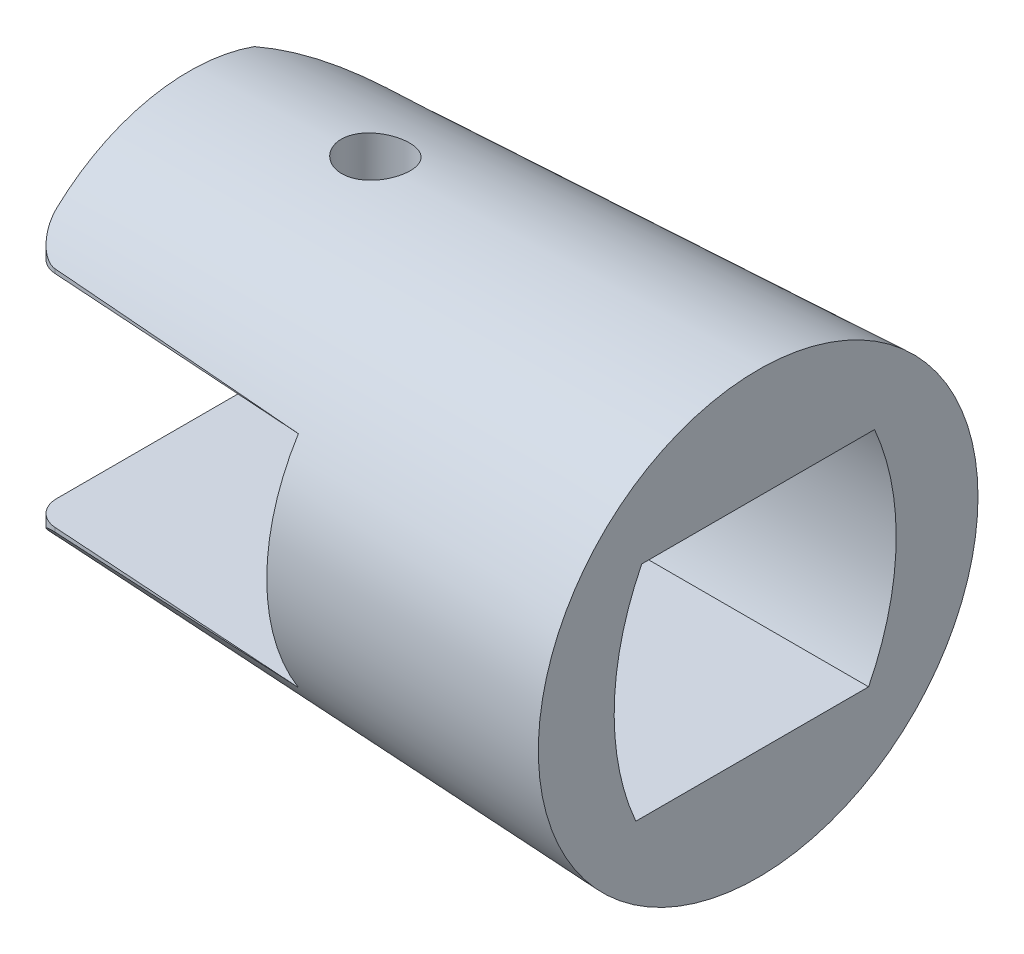
ISO-10303-21;
HEADER;
FILE_DESCRIPTION(('STEP AP214'),'2;1');
FILE_NAME('part.step','',(''),(''),'','','');
FILE_SCHEMA(('AUTOMOTIVE_DESIGN { 1 0 10303 214 1 1 1 1 }'));
ENDSEC;
DATA;
#1=APPLICATION_CONTEXT('core data for automotive mechanical design processes');
#2=APPLICATION_PROTOCOL_DEFINITION('international standard','automotive_design',2000,#1);
#3=PRODUCT_CONTEXT('',#1,'mechanical');
#4=PRODUCT('Part','Part','',(#3));
#5=PRODUCT_RELATED_PRODUCT_CATEGORY('part','',(#4));
#6=PRODUCT_DEFINITION_FORMATION('','',#4);
#7=PRODUCT_DEFINITION_CONTEXT('part definition',#1,'design');
#8=PRODUCT_DEFINITION('design','',#6,#7);
#9=PRODUCT_DEFINITION_SHAPE('','',#8);
#10=(LENGTH_UNIT() NAMED_UNIT(*) SI_UNIT(.MILLI.,.METRE.));
#11=(NAMED_UNIT(*) PLANE_ANGLE_UNIT() SI_UNIT($,.RADIAN.));
#12=(NAMED_UNIT(*) SI_UNIT($,.STERADIAN.) SOLID_ANGLE_UNIT());
#13=UNCERTAINTY_MEASURE_WITH_UNIT(LENGTH_MEASURE(1.E-05),#10,'distance_accuracy_value','');
#14=(GEOMETRIC_REPRESENTATION_CONTEXT(3) GLOBAL_UNCERTAINTY_ASSIGNED_CONTEXT((#13)) GLOBAL_UNIT_ASSIGNED_CONTEXT((#10,
#11,#12)) REPRESENTATION_CONTEXT('',''));
#15=CARTESIAN_POINT('',(0.,0.,0.));
#16=DIRECTION('',(0.,0.,1.));
#17=DIRECTION('',(1.,0.,0.));
#18=AXIS2_PLACEMENT_3D('',#15,#16,#17);
#19=CARTESIAN_POINT('',(-11.605,4.48375,-10.55));
#20=DIRECTION('',(1.,0.,0.));
#21=DIRECTION('',(0.,1.,0.));
#22=AXIS2_PLACEMENT_3D('',#19,#20,#21);
#23=PLANE('',#22);
#24=DIRECTION('',(0.,0.,1.));
#25=VECTOR('',#24,1.);
#26=CARTESIAN_POINT('',(-11.605,4.48375,-10.55));
#27=LINE('',#26,#25);
#28=CARTESIAN_POINT('',(-11.605,4.48375,4.7475));
#29=VERTEX_POINT('',#28);
#30=CARTESIAN_POINT('',(-11.605,4.48375,7.15049550293545));
#31=VERTEX_POINT('',#30);
#32=EDGE_CURVE('E220',#29,#31,#27,.T.);
#33=ORIENTED_EDGE('',*,*,#32,.F.);
#34=CARTESIAN_POINT('',(-11.605,-0.258290682961154,-4.67670023986871));
#35=DIRECTION('',(1.,0.,0.));
#36=DIRECTION('',(0.,1.,0.));
#37=AXIS2_PLACEMENT_3D('',#34,#35,#36);
#38=CIRCLE('',#37,10.55);
#39=CARTESIAN_POINT('',(-11.605,-4.48375,4.99015));
#40=VERTEX_POINT('',#39);
#41=EDGE_CURVE('E238',#29,#40,#38,.T.);
#42=ORIENTED_EDGE('',*,*,#41,.T.);
#43=DIRECTION('',(0.,0.,1.));
#44=VECTOR('',#43,1.);
#45=CARTESIAN_POINT('',(-11.605,-4.48375,-10.55));
#46=LINE('',#45,#44);
#47=CARTESIAN_POINT('',(-11.605,-4.48375,7.15049550293544));
#48=VERTEX_POINT('',#47);
#49=EDGE_CURVE('E215',#40,#48,#46,.T.);
#50=ORIENTED_EDGE('',*,*,#49,.T.);
#51=CARTESIAN_POINT('',(-11.605,0.,0.));
#52=DIRECTION('',(1.,0.,0.));
#53=DIRECTION('',(0.,1.,0.));
#54=AXIS2_PLACEMENT_3D('',#51,#52,#53);
#55=CIRCLE('',#54,8.44);
#56=EDGE_CURVE('E366',#48,#31,#55,.F.);
#57=ORIENTED_EDGE('',*,*,#56,.T.);
#58=EDGE_LOOP('',(#33,#42,#50,#57));
#59=FACE_BOUND('',#58,.T.);
#60=ADVANCED_FACE('F40',(#59),#23,.F.);
#61=CARTESIAN_POINT('',(-26.3539,4.48375,-10.55));
#62=DIRECTION('',(0.,1.,0.));
#63=DIRECTION('',(0.,0.,1.));
#64=AXIS2_PLACEMENT_3D('',#61,#62,#63);
#65=PLANE('',#64);
#66=DIRECTION('',(-0.997866486605557,0.,-0.0652876321325967));
#67=VECTOR('',#66,1.);
#68=CARTESIAN_POINT('',(-27.4441910846819,4.48375,6.11418123174238));
#69=LINE('',#68,#67);
#70=CARTESIAN_POINT('',(-22.2238784518999,4.48375,6.45573178520931));
#71=VERTEX_POINT('',#70);
#72=EDGE_CURVE('E207',#31,#71,#69,.T.);
#73=ORIENTED_EDGE('',*,*,#72,.T.);
#74=CARTESIAN_POINT('',(-22.155,4.48375,5.40298264184044));
#75=DIRECTION('',(0.,1.,0.));
#76=DIRECTION('',(0.,0.,1.));
#77=AXIS2_PLACEMENT_3D('',#74,#75,#76);
#78=CIRCLE('',#77,1.055);
#79=CARTESIAN_POINT('',(-23.21,4.48375,5.40298264184044));
#80=VERTEX_POINT('',#79);
#81=EDGE_CURVE('E12',#71,#80,#78,.F.);
#82=ORIENTED_EDGE('',*,*,#81,.T.);
#83=DIRECTION('',(0.,0.,1.));
#84=VECTOR('',#83,1.);
#85=CARTESIAN_POINT('',(-23.21,4.48375,0.));
#86=LINE('',#85,#84);
#87=CARTESIAN_POINT('',(-23.21,4.48375,-2.65564999067094));
#88=VERTEX_POINT('',#87);
#89=EDGE_CURVE('E230',#88,#80,#86,.T.);
#90=ORIENTED_EDGE('',*,*,#89,.F.);
#91=CARTESIAN_POINT('',(-15.4663,4.48375,1.52193687257918));
#92=DIRECTION('',(0.,1.,0.));
#93=DIRECTION('',(0.,0.,1.));
#94=AXIS2_PLACEMENT_3D('',#91,#92,#93);
#95=CIRCLE('',#94,8.7987);
#96=CARTESIAN_POINT('',(-18.3666793449828,4.48375,-6.78498321522742));
#97=VERTEX_POINT('',#96);
#98=EDGE_CURVE('E193',#88,#97,#95,.F.);
#99=ORIENTED_EDGE('',*,*,#98,.T.);
#100=CARTESIAN_POINT('',(-44.5726728138678,4.48375,-5.299054973512));
#101=CARTESIAN_POINT('',(-42.3632557991479,4.48375,-5.43057600760556));
#102=CARTESIAN_POINT('',(-40.1537228781907,4.48375,-5.56013068389908));
#103=CARTESIAN_POINT('',(-35.7344699549912,4.48375,-5.81592825272662));
#104=CARTESIAN_POINT('',(-33.5247499531615,4.48375,-5.94217115238378));
#105=CARTESIAN_POINT('',(-27.8927760109839,4.48375,-6.26049054385434));
#106=CARTESIAN_POINT('',(-24.4704159019874,4.48375,-6.45068613810378));
#107=CARTESIAN_POINT('',(-17.6254235537313,4.48375,-6.82613940047241));
#108=CARTESIAN_POINT('',(-14.2027913143114,4.48375,-7.01139706565928));
#109=CARTESIAN_POINT('',(-7.35729570575324,4.48375,-7.37803776065809));
#110=CARTESIAN_POINT('',(-3.93443233516793,4.48375,-7.55942076340467));
#111=CARTESIAN_POINT('',(2.91145568007266,4.48375,-7.91902922244784));
#112=CARTESIAN_POINT('',(6.33448032450069,4.48375,-8.09725468306763));
#113=CARTESIAN_POINT('',(9.75756731386789,4.48375,-8.27426083109337));
#114=B_SPLINE_CURVE_WITH_KNOTS('',3,(#100,#101,#102,#103,#104,#105,#106,#107,#108,#109,#110,
#111,#112,#113),.UNSPECIFIED.,.F.,.F.,(4,2,2,2,2,2,4),(0.,6.639981763878,13.2799492449581,
23.5628674158611,33.8457916930049,44.1287877751667,54.4117697771162),.UNSPECIFIED.);
#115=CARTESIAN_POINT('',(-11.605,4.48375,-7.15049550293545));
#116=VERTEX_POINT('',#115);
#117=EDGE_CURVE('E294',#97,#116,#114,.T.);
#118=ORIENTED_EDGE('',*,*,#117,.T.);
#119=CARTESIAN_POINT('',(-11.605,4.48375,-4.7475));
#120=VERTEX_POINT('',#119);
#121=EDGE_CURVE('E216',#116,#120,#27,.T.);
#122=ORIENTED_EDGE('',*,*,#121,.T.);
#123=DIRECTION('',(1.,0.,0.));
#124=VECTOR('',#123,1.);
#125=CARTESIAN_POINT('',(-12.66,4.48375,-4.7475));
#126=LINE('',#125,#124);
#127=CARTESIAN_POINT('',(0.,4.48375,-4.7475));
#128=VERTEX_POINT('',#127);
#129=EDGE_CURVE('E155',#120,#128,#126,.T.);
#130=ORIENTED_EDGE('',*,*,#129,.T.);
#131=DIRECTION('',(0.,0.,1.));
#132=VECTOR('',#131,1.);
#133=CARTESIAN_POINT('',(0.,4.48375,4.7475));
#134=LINE('',#133,#132);
#135=CARTESIAN_POINT('',(0.,4.48375,4.7475));
#136=VERTEX_POINT('',#135);
#137=EDGE_CURVE('E172',#128,#136,#134,.T.);
#138=ORIENTED_EDGE('',*,*,#137,.T.);
#139=DIRECTION('',(1.,0.,0.));
#140=VECTOR('',#139,1.);
#141=CARTESIAN_POINT('',(-12.66,4.48375,4.7475));
#142=LINE('',#141,#140);
#143=EDGE_CURVE('E177',#29,#136,#142,.T.);
#144=ORIENTED_EDGE('',*,*,#143,.F.);
#145=ORIENTED_EDGE('',*,*,#32,.T.);
#146=EDGE_LOOP('',(#73,#82,#90,#99,#118,#122,#130,#138,#144,#145));
#147=FACE_BOUND('',#146,.T.);
#148=CARTESIAN_POINT('',(-16.1415,4.48375,-0.527500000000002));
#149=DIRECTION('',(0.,1.,0.));
#150=DIRECTION('',(0.,0.,1.));
#151=AXIS2_PLACEMENT_3D('',#148,#149,#150);
#152=CIRCLE('',#151,1.31875);
#153=CARTESIAN_POINT('',(-16.1415,4.48375,0.791249999999997));
#154=VERTEX_POINT('',#153);
#155=EDGE_CURVE('E185',#154,#154,#152,.T.);
#156=ORIENTED_EDGE('',*,*,#155,.T.);
#157=EDGE_LOOP('',(#156));
#158=FACE_BOUND('',#157,.T.);
#159=ADVANCED_FACE('F343',(#147,#158),#65,.F.);
#160=CARTESIAN_POINT('',(-26.3539,-4.48375,-10.55));
#161=DIRECTION('',(0.,-1.,0.));
#162=DIRECTION('',(0.,0.,-1.));
#163=AXIS2_PLACEMENT_3D('',#160,#161,#162);
#164=PLANE('',#163);
#165=DIRECTION('',(0.,0.,-1.));
#166=VECTOR('',#165,1.);
#167=CARTESIAN_POINT('',(-23.21,-4.48375,0.));
#168=LINE('',#167,#166);
#169=CARTESIAN_POINT('',(-23.21,-4.48375,5.40298264184044));
#170=VERTEX_POINT('',#169);
#171=CARTESIAN_POINT('',(-23.21,-4.48375,-2.65564999067094));
#172=VERTEX_POINT('',#171);
#173=EDGE_CURVE('E219',#170,#172,#168,.T.);
#174=ORIENTED_EDGE('',*,*,#173,.F.);
#175=CARTESIAN_POINT('',(-22.155,-4.48375,5.40298264184044));
#176=DIRECTION('',(0.,-1.,0.));
#177=DIRECTION('',(0.,0.,-1.));
#178=AXIS2_PLACEMENT_3D('',#175,#176,#177);
#179=CIRCLE('',#178,1.055);
#180=CARTESIAN_POINT('',(-22.2238784518999,-4.48375,6.45573178520931));
#181=VERTEX_POINT('',#180);
#182=EDGE_CURVE('E237',#170,#181,#179,.F.);
#183=ORIENTED_EDGE('',*,*,#182,.T.);
#184=DIRECTION('',(0.997866486605557,0.,0.0652876321325967));
#185=VECTOR('',#184,1.);
#186=CARTESIAN_POINT('',(-27.4441910846819,-4.48375,6.11418123174238));
#187=LINE('',#186,#185);
#188=EDGE_CURVE('E383',#181,#48,#187,.T.);
#189=ORIENTED_EDGE('',*,*,#188,.T.);
#190=ORIENTED_EDGE('',*,*,#49,.F.);
#191=DIRECTION('',(1.,0.,0.));
#192=VECTOR('',#191,1.);
#193=CARTESIAN_POINT('',(-12.66,-4.48375,4.99015));
#194=LINE('',#193,#192);
#195=CARTESIAN_POINT('',(0.,-4.48375,4.99015));
#196=VERTEX_POINT('',#195);
#197=EDGE_CURVE('E156',#40,#196,#194,.T.);
#198=ORIENTED_EDGE('',*,*,#197,.T.);
#199=DIRECTION('',(0.,0.,-1.));
#200=VECTOR('',#199,1.);
#201=CARTESIAN_POINT('',(0.,-4.48375,4.99015));
#202=LINE('',#201,#200);
#203=CARTESIAN_POINT('',(0.,-4.48375,-4.50485));
#204=VERTEX_POINT('',#203);
#205=EDGE_CURVE('E160',#196,#204,#202,.T.);
#206=ORIENTED_EDGE('',*,*,#205,.T.);
#207=DIRECTION('',(1.,0.,0.));
#208=VECTOR('',#207,1.);
#209=CARTESIAN_POINT('',(-12.66,-4.48375,-4.50485));
#210=LINE('',#209,#208);
#211=CARTESIAN_POINT('',(-11.605,-4.48375,-4.50485));
#212=VERTEX_POINT('',#211);
#213=EDGE_CURVE('E144',#212,#204,#210,.T.);
#214=ORIENTED_EDGE('',*,*,#213,.F.);
#215=CARTESIAN_POINT('',(-11.605,-4.48375,-7.15049550293544));
#216=VERTEX_POINT('',#215);
#217=EDGE_CURVE('E221',#216,#212,#46,.T.);
#218=ORIENTED_EDGE('',*,*,#217,.F.);
#219=CARTESIAN_POINT('',(9.75756731386789,-4.48375,-8.27426083109337));
#220=CARTESIAN_POINT('',(6.76081513792658,-4.48375,-8.11931135386581));
#221=CARTESIAN_POINT('',(3.76411162587657,-4.48375,-7.96341368107027));
#222=CARTESIAN_POINT('',(-2.22916595103775,-4.48375,-7.64926372516363));
#223=CARTESIAN_POINT('',(-5.22574001614723,-4.48375,-7.49101144672747));
#224=CARTESIAN_POINT('',(-11.2518734534107,-4.48375,-7.16992795627611));
#225=CARTESIAN_POINT('',(-14.2814311613988,-4.48375,-7.00706546151415));
#226=CARTESIAN_POINT('',(-20.3403534260021,-4.48375,-6.6777987846476));
#227=CARTESIAN_POINT('',(-23.3697179826739,-4.48375,-6.51139460358648));
#228=CARTESIAN_POINT('',(-29.4282131322181,-4.48375,-6.17415191948557));
#229=CARTESIAN_POINT('',(-32.4573437241116,-4.48375,-6.00331339880318));
#230=CARTESIAN_POINT('',(-37.0007957088804,-4.48375,-5.74277052608293));
#231=CARTESIAN_POINT('',(-38.515239970922,-4.48375,-5.65520866553543));
#232=CARTESIAN_POINT('',(-41.5440323218638,-4.48375,-5.47842983401376));
#233=CARTESIAN_POINT('',(-43.058380410734,-4.48375,-5.38921286252695));
#234=CARTESIAN_POINT('',(-44.5726728138679,-4.48375,-5.29905497351199));
#235=B_SPLINE_CURVE_WITH_KNOTS('',3,(#219,#220,#221,#222,#223,#224,#225,#226,#227,#228,#229,
#230,#231,#232,#233,#234),.UNSPECIFIED.,.F.,.F.,(4,2,2,2,2,2,2,4),(0.,9.00226657237608,
18.0045152736493,27.1063098999938,36.2081018447502,45.3099300077749,49.860849604712,
54.4117706112821),.UNSPECIFIED.);
#236=CARTESIAN_POINT('',(-18.3666793449826,-4.48375,-6.78498321522702));
#237=VERTEX_POINT('',#236);
#238=EDGE_CURVE('E286',#216,#237,#235,.T.);
#239=ORIENTED_EDGE('',*,*,#238,.T.);
#240=CARTESIAN_POINT('',(-15.4663,-4.48375,1.52193687257918));
#241=DIRECTION('',(0.,-1.,0.));
#242=DIRECTION('',(0.,0.,-1.));
#243=AXIS2_PLACEMENT_3D('',#240,#241,#242);
#244=CIRCLE('',#243,8.7987);
#245=EDGE_CURVE('E403',#237,#172,#244,.F.);
#246=ORIENTED_EDGE('',*,*,#245,.T.);
#247=EDGE_LOOP('',(#174,#183,#189,#190,#198,#206,#214,#218,#239,#246));
#248=FACE_BOUND('',#247,.T.);
#249=CARTESIAN_POINT('',(-16.1415,-4.48375,-0.527500000000002));
#250=DIRECTION('',(0.,-1.,0.));
#251=DIRECTION('',(0.,0.,-1.));
#252=AXIS2_PLACEMENT_3D('',#249,#250,#251);
#253=CIRCLE('',#252,1.31875);
#254=CARTESIAN_POINT('',(-16.1415,-4.48375,-1.84625));
#255=VERTEX_POINT('',#254);
#256=EDGE_CURVE('E182',#255,#255,#253,.T.);
#257=ORIENTED_EDGE('',*,*,#256,.T.);
#258=EDGE_LOOP('',(#257));
#259=FACE_BOUND('',#258,.T.);
#260=ADVANCED_FACE('F162',(#248,#259),#164,.F.);
#261=CARTESIAN_POINT('',(-23.21,0.,0.));
#262=DIRECTION('',(1.,0.,0.));
#263=DIRECTION('',(0.,0.,-1.));
#264=AXIS2_PLACEMENT_3D('',#261,#262,#263);
#265=PLANE('',#264);
#266=ORIENTED_EDGE('',*,*,#89,.T.);
#267=DIRECTION('',(0.,1.,0.));
#268=VECTOR('',#267,1.);
#269=CARTESIAN_POINT('',(-23.21,0.,5.40298264184044));
#270=LINE('',#269,#268);
#271=CARTESIAN_POINT('',(-23.21,5.78060746384151,5.40298300002569));
#272=VERTEX_POINT('',#271);
#273=EDGE_CURVE('E250',#80,#272,#270,.T.);
#274=ORIENTED_EDGE('',*,*,#273,.T.);
#275=CARTESIAN_POINT('',(-23.21,0.,0.));
#276=DIRECTION('',(1.,0.,0.));
#277=DIRECTION('',(0.,0.,-1.));
#278=AXIS2_PLACEMENT_3D('',#275,#276,#277);
#279=CIRCLE('',#278,7.9125);
#280=CARTESIAN_POINT('',(-23.2099999999998,7.45353469013513,-2.65564999067126));
#281=VERTEX_POINT('',#280);
#282=EDGE_CURVE('E375',#281,#272,#279,.T.);
#283=ORIENTED_EDGE('',*,*,#282,.F.);
#284=DIRECTION('',(0.,1.,0.));
#285=VECTOR('',#284,1.);
#286=CARTESIAN_POINT('',(-23.21,-10.55,-2.65564999067094));
#287=LINE('',#286,#285);
#288=EDGE_CURVE('E199',#281,#88,#287,.F.);
#289=ORIENTED_EDGE('',*,*,#288,.T.);
#290=EDGE_LOOP('',(#266,#274,#283,#289));
#291=FACE_BOUND('',#290,.T.);
#292=ADVANCED_FACE('F352',(#291),#265,.F.);
#293=CARTESIAN_POINT('',(0.,0.,0.));
#294=DIRECTION('',(1.,0.,0.));
#295=DIRECTION('',(0.,0.,-1.));
#296=AXIS2_PLACEMENT_3D('',#293,#294,#295);
#297=PLANE('',#296);
#298=CARTESIAN_POINT('',(0.,-0.258290682961154,-4.67670023986871));
#299=DIRECTION('',(1.,0.,0.));
#300=DIRECTION('',(0.,0.,-1.));
#301=AXIS2_PLACEMENT_3D('',#298,#299,#300);
#302=CIRCLE('',#301,10.55);
#303=EDGE_CURVE('E167',#136,#196,#302,.T.);
#304=ORIENTED_EDGE('',*,*,#303,.F.);
#305=ORIENTED_EDGE('',*,*,#137,.F.);
#306=CARTESIAN_POINT('',(0.,0.258290682961155,4.91935023986871));
#307=DIRECTION('',(1.,0.,0.));
#308=DIRECTION('',(0.,0.,1.));
#309=AXIS2_PLACEMENT_3D('',#306,#307,#308);
#310=CIRCLE('',#309,10.55);
#311=EDGE_CURVE('E148',#204,#128,#310,.T.);
#312=ORIENTED_EDGE('',*,*,#311,.F.);
#313=ORIENTED_EDGE('',*,*,#205,.F.);
#314=EDGE_LOOP('',(#304,#305,#312,#313));
#315=FACE_BOUND('',#314,.T.);
#316=CARTESIAN_POINT('',(0.,0.,0.));
#317=DIRECTION('',(1.,0.,0.));
#318=DIRECTION('',(0.,0.,-1.));
#319=AXIS2_PLACEMENT_3D('',#316,#317,#318);
#320=CIRCLE('',#319,8.9675);
#321=CARTESIAN_POINT('',(0.,0.,-8.9675));
#322=VERTEX_POINT('',#321);
#323=EDGE_CURVE('E413',#322,#322,#320,.T.);
#324=ORIENTED_EDGE('',*,*,#323,.T.);
#325=EDGE_LOOP('',(#324));
#326=FACE_BOUND('',#325,.T.);
#327=ADVANCED_FACE('F169',(#315,#326),#297,.T.);
#328=CARTESIAN_POINT('',(-23.21,-5.78061093435922,5.40298181924811));
#329=VERTEX_POINT('',#328);
#330=CARTESIAN_POINT('',(-23.2099999999997,-7.45353469013508,-2.65564999067144));
#331=VERTEX_POINT('',#330);
#332=EDGE_CURVE('E379',#329,#331,#279,.T.);
#333=ORIENTED_EDGE('',*,*,#332,.F.);
#334=DIRECTION('',(0.,1.,0.));
#335=VECTOR('',#334,1.);
#336=CARTESIAN_POINT('',(-23.21,0.,5.40298264184044));
#337=LINE('',#336,#335);
#338=EDGE_CURVE('E234',#329,#170,#337,.T.);
#339=ORIENTED_EDGE('',*,*,#338,.T.);
#340=ORIENTED_EDGE('',*,*,#173,.T.);
#341=DIRECTION('',(0.,1.,0.));
#342=VECTOR('',#341,1.);
#343=CARTESIAN_POINT('',(-23.21,-10.55,-2.65564999067094));
#344=LINE('',#343,#342);
#345=EDGE_CURVE('E190',#172,#331,#344,.F.);
#346=ORIENTED_EDGE('',*,*,#345,.T.);
#347=EDGE_LOOP('',(#333,#339,#340,#346));
#348=FACE_BOUND('',#347,.T.);
#349=ADVANCED_FACE('F269',(#348),#265,.F.);
#350=CARTESIAN_POINT('',(-23.21,0.,0.));
#351=DIRECTION('',(1.,0.,0.));
#352=DIRECTION('',(0.,0.,-1.));
#353=AXIS2_PLACEMENT_3D('',#350,#351,#352);
#354=CONICAL_SURFACE('',#353,7.9125,0.0454232794215769);
#355=CARTESIAN_POINT('',(-17.2548440053607,-8.08956633232779,-1.2343003170822));
#356=CARTESIAN_POINT('',(-17.2152185245078,-8.08186499791986,-1.296713214045));
#357=CARTESIAN_POINT('',(-17.170312438701,-8.07417381548192,-1.35582242798965));
#358=CARTESIAN_POINT('',(-17.0711457611492,-8.05952308985586,-1.46576969851495));
#359=CARTESIAN_POINT('',(-17.0168767224265,-8.05256421654207,-1.51660020508738));
#360=CARTESIAN_POINT('',(-16.9004469289519,-8.04010586170184,-1.60851874114574));
#361=CARTESIAN_POINT('',(-16.838283814141,-8.03460681814035,-1.64960384651162));
#362=CARTESIAN_POINT('',(-16.7078263639348,-8.02573187317943,-1.7207706218764));
#363=CARTESIAN_POINT('',(-16.6395338341232,-8.02235534886554,-1.75085551911813));
#364=CARTESIAN_POINT('',(-16.4997018024758,-8.01825669444364,-1.79879229786896));
#365=CARTESIAN_POINT('',(-16.4282162778399,-8.01750051287801,-1.81679863711919));
#366=CARTESIAN_POINT('',(-16.2832723944307,-8.0188156961139,-1.84066244959497));
#367=CARTESIAN_POINT('',(-16.2098141737833,-8.02088686345134,-1.84652077117487));
#368=CARTESIAN_POINT('',(-16.0641728422766,-8.02780776777248,-1.84596404558471));
#369=CARTESIAN_POINT('',(-15.9919869393389,-8.03261596221392,-1.83972921638151));
#370=CARTESIAN_POINT('',(-15.8498092595859,-8.044727713876,-1.81560642657374));
#371=CARTESIAN_POINT('',(-15.7798175841622,-8.05203138622373,-1.79771792830092));
#372=CARTESIAN_POINT('',(-15.6432480670361,-8.0687465068655,-1.75065722456308));
#373=CARTESIAN_POINT('',(-15.5767094466893,-8.07817751592438,-1.72137834843787));
#374=CARTESIAN_POINT('',(-15.4494919832247,-8.09846424042409,-1.65242815595375));
#375=CARTESIAN_POINT('',(-15.3888140170178,-8.10932016849953,-1.61275528766183));
#376=CARTESIAN_POINT('',(-15.2733423762967,-8.13201321946185,-1.52293589256548));
#377=CARTESIAN_POINT('',(-15.2187442412933,-8.14386858492579,-1.47254244903842));
#378=CARTESIAN_POINT('',(-15.1187491273471,-8.16747346957906,-1.36330291132481));
#379=CARTESIAN_POINT('',(-15.0733530817,-8.17922297791678,-1.30445596079866));
#380=CARTESIAN_POINT('',(-14.992474054527,-8.20196341238432,-1.17902283697763));
#381=CARTESIAN_POINT('',(-14.9571305845765,-8.21294220588705,-1.11234434267771));
#382=CARTESIAN_POINT('',(-14.8982555788379,-8.23322218408151,-0.973721761263125));
#383=CARTESIAN_POINT('',(-14.8747230190693,-8.24252351416091,-0.901778131244293));
#384=CARTESIAN_POINT('',(-14.8405119381924,-8.25874900490511,-0.755708431867646));
#385=CARTESIAN_POINT('',(-14.8296583279287,-8.26570457861716,-0.681626929889295));
#386=CARTESIAN_POINT('',(-14.8206465308032,-8.27705951148675,-0.532503657216621));
#387=CARTESIAN_POINT('',(-14.8224864803728,-8.28145924576974,-0.45746202909508));
#388=CARTESIAN_POINT('',(-14.8386945566376,-8.28752433869642,-0.310354444601269));
#389=CARTESIAN_POINT('',(-14.8527790090414,-8.28924916613725,-0.238259553109227));
#390=CARTESIAN_POINT('',(-14.8927139809338,-8.290285728827,-0.0973904457742301));
#391=CARTESIAN_POINT('',(-14.9185640920053,-8.28959754783226,-0.0286161147574921));
#392=CARTESIAN_POINT('',(-14.9811007479298,-8.28615866359503,0.103270897475588));
#393=CARTESIAN_POINT('',(-15.0177247029425,-8.28341973579573,0.166413607860451));
#394=CARTESIAN_POINT('',(-15.1008200144054,-8.27638353898312,0.285749150275331));
#395=CARTESIAN_POINT('',(-15.1472920317029,-8.27208616537764,0.341941515506374));
#396=CARTESIAN_POINT('',(-15.2494111029258,-8.26245779157363,0.446503942224831));
#397=CARTESIAN_POINT('',(-15.3051623918262,-8.25711491124681,0.494771102759865));
#398=CARTESIAN_POINT('',(-15.4238939397115,-8.2460619338629,0.581347224631326));
#399=CARTESIAN_POINT('',(-15.4868746719202,-8.24035181277781,0.619655533546244));
#400=CARTESIAN_POINT('',(-15.6190809531505,-8.22909648478802,0.685635431365552));
#401=CARTESIAN_POINT('',(-15.6883680966907,-8.22355381419649,0.713184145223243));
#402=CARTESIAN_POINT('',(-15.8306410274757,-8.21321230152173,0.756241371930711));
#403=CARTESIAN_POINT('',(-15.9036267635509,-8.20841344915158,0.771750051304443));
#404=CARTESIAN_POINT('',(-16.0511247833695,-8.19991834619557,0.790244258155512));
#405=CARTESIAN_POINT('',(-16.1256346920981,-8.19622050187446,0.793247969504222));
#406=CARTESIAN_POINT('',(-16.2741473490574,-8.19007326609329,0.786665350682763));
#407=CARTESIAN_POINT('',(-16.3481501149388,-8.1876238309633,0.777079460944745));
#408=CARTESIAN_POINT('',(-16.4930804283696,-8.18392867489601,0.745668606864103));
#409=CARTESIAN_POINT('',(-16.5640235981525,-8.18267590821994,0.723916492624601));
#410=CARTESIAN_POINT('',(-16.7012752209843,-8.18110203740212,0.668836615824816));
#411=CARTESIAN_POINT('',(-16.7675836251641,-8.18078094308255,0.635508731230782));
#412=CARTESIAN_POINT('',(-16.8936940156907,-8.18067204813826,0.558214683272482));
#413=CARTESIAN_POINT('',(-16.9534948931402,-8.18088433825546,0.514246710915428));
#414=CARTESIAN_POINT('',(-17.0648899531055,-8.1813509207986,0.416916848669633));
#415=CARTESIAN_POINT('',(-17.1164839981846,-8.1816052139278,0.363554801493424));
#416=CARTESIAN_POINT('',(-17.2101261453537,-8.18164047802465,0.248797550325327));
#417=CARTESIAN_POINT('',(-17.2521498037677,-8.18142025168928,0.187382393941846));
#418=CARTESIAN_POINT('',(-17.3252843256725,-8.18003255131858,0.0583782587944109));
#419=CARTESIAN_POINT('',(-17.3563957845442,-8.17886512897478,-0.00921038288406571));
#420=CARTESIAN_POINT('',(-17.406761485043,-8.17523146365278,-0.148445646543408));
#421=CARTESIAN_POINT('',(-17.42604518824,-8.17276847646902,-0.220081696270733));
#422=CARTESIAN_POINT('',(-17.4523489971103,-8.16635924248619,-0.365519462033869));
#423=CARTESIAN_POINT('',(-17.4593671428837,-8.16241275876324,-0.439321522258762));
#424=CARTESIAN_POINT('',(-17.4609749142231,-8.15306221917518,-0.586814379012447));
#425=CARTESIAN_POINT('',(-17.4555890058202,-8.14766105112209,-0.660505108180777));
#426=CARTESIAN_POINT('',(-17.4326407811074,-8.13562211623521,-0.805814739977354));
#427=CARTESIAN_POINT('',(-17.4150886477056,-8.1289853869388,-0.877435323097158));
#428=CARTESIAN_POINT('',(-17.3748141189086,-8.11683399882339,-0.997472460886077));
#429=CARTESIAN_POINT('',(-17.354842885293,-8.1115130075448,-1.04685167599308));
#430=CARTESIAN_POINT('',(-17.3091061495763,-8.10064837347078,-1.14282358299337));
#431=CARTESIAN_POINT('',(-17.2833405709671,-8.09510472773623,-1.18941623808282));
#432=CARTESIAN_POINT('',(-17.2548440053607,-8.08956633232779,-1.2343003170822));
#433=B_SPLINE_CURVE_WITH_KNOTS('',3,(#355,#356,#357,#358,#359,#360,#361,#362,#363,#364,#365,
#366,#367,#368,#369,#370,#371,#372,#373,#374,#375,#376,#377,#378,#379,#380,#381,#382,#383,#384,
#385,#386,#387,#388,#389,#390,#391,#392,#393,#394,#395,#396,#397,#398,#399,#400,#401,#402,#403,
#404,#405,#406,#407,#408,#409,#410,#411,#412,#413,#414,#415,#416,#417,#418,#419,#420,#421,#422,
#423,#424,#425,#426,#427,#428,#429,#430,#431,#432),.UNSPECIFIED.,.T.,.F.,(4,2,2,2,2,2,2,2,2,2,2,
2,2,2,2,2,2,2,2,2,2,2,2,2,2,2,2,2,2,2,2,2,2,2,2,2,2,2,4),(0.,0.222797407350799,
0.445796877120801,0.668863173763428,0.891863974569758,1.11195577553432,1.33203220591457,
1.54885413664798,1.76568607165767,1.98459950752644,2.20354564813372,2.42822139525514,
2.65291991808315,2.88059961012169,3.10825955940874,3.33273702965901,3.55718154459147,
3.77656077298658,3.99593238672934,4.21405393115257,4.43219011710622,4.65296631993826,
4.87375698255662,5.09700010305971,5.32024013586484,5.54315543461481,5.76606293514712,
5.98764976165772,6.20923892424547,6.43086578719597,6.65249636125637,6.87468680621742,
7.09686512635006,7.31848775435681,7.54014579196143,7.7613670008771,7.98240327491011,
8.14262535837327,8.30284955752156),.UNSPECIFIED.);
#434=CARTESIAN_POINT('',(-17.2548440053607,-8.08956633232779,-1.2343003170822));
#435=VERTEX_POINT('',#434);
#436=EDGE_CURVE('E186',#435,#435,#433,.T.);
#437=ORIENTED_EDGE('',*,*,#436,.F.);
#438=EDGE_LOOP('',(#437));
#439=FACE_BOUND('',#438,.T.);
#440=CARTESIAN_POINT('',(-17.2548440053607,8.08956633232779,-1.2343003170822));
#441=CARTESIAN_POINT('',(-17.29457598624,8.0972884864401,-1.17170985425053));
#442=CARTESIAN_POINT('',(-17.3290414445378,8.10502905719172,-1.1057281490267));
#443=CARTESIAN_POINT('',(-17.3864366840481,8.11990606743461,-0.968809205126298));
#444=CARTESIAN_POINT('',(-17.4093557946514,8.12704194304795,-0.897867451280647));
#445=CARTESIAN_POINT('',(-17.4429455443328,8.14020540525359,-0.753032607017944));
#446=CARTESIAN_POINT('',(-17.4536161491582,8.14623298874653,-0.679139508348098));
#447=CARTESIAN_POINT('',(-17.462345065199,8.1568617500663,-0.530526240880495));
#448=CARTESIAN_POINT('',(-17.4604064469297,8.16146327487165,-0.45580627785932));
#449=CARTESIAN_POINT('',(-17.4439912833026,8.16911165983609,-0.308194666076865));
#450=CARTESIAN_POINT('',(-17.4296005848536,8.17216893823491,-0.235294007670446));
#451=CARTESIAN_POINT('',(-17.3887797474685,8.1768837085509,-0.0928959618022966));
#452=CARTESIAN_POINT('',(-17.3623493908726,8.1785411751599,-0.0233986358931636));
#453=CARTESIAN_POINT('',(-17.2983303976905,8.18074464424766,0.109908673417067));
#454=CARTESIAN_POINT('',(-17.2607888901858,8.18129526616254,0.173741227143277));
#455=CARTESIAN_POINT('',(-17.1755667779224,8.18172515101173,0.294237963993144));
#456=CARTESIAN_POINT('',(-17.1278859679525,8.18160440035678,0.350902001994904));
#457=CARTESIAN_POINT('',(-17.023553797305,8.18119176784867,0.455640141815693));
#458=CARTESIAN_POINT('',(-16.9668731817351,8.18089931920591,0.503685102316401));
#459=CARTESIAN_POINT('',(-16.8462590103954,8.1806543715958,0.589593679547285));
#460=CARTESIAN_POINT('',(-16.7823254615075,8.18070187230589,0.627457305937808));
#461=CARTESIAN_POINT('',(-16.6489391382359,8.18158336281408,0.69196781736734));
#462=CARTESIAN_POINT('',(-16.579479898648,8.18241828668858,0.718601326435089));
#463=CARTESIAN_POINT('',(-16.4370978967862,8.18519303064242,0.759829128117809));
#464=CARTESIAN_POINT('',(-16.3641752215981,8.18713282295404,0.774423723274093));
#465=CARTESIAN_POINT('',(-16.2171698260681,8.19224691630403,0.791148070508237));
#466=CARTESIAN_POINT('',(-16.1430910233301,8.19541766809848,0.793313379320753));
#467=CARTESIAN_POINT('',(-15.9956731644126,8.20292651667826,0.785239787121804));
#468=CARTESIAN_POINT('',(-15.9223341185597,8.20726462973606,0.775000713191993));
#469=CARTESIAN_POINT('',(-15.778348692322,8.21684771476534,0.742413124747286));
#470=CARTESIAN_POINT('',(-15.7077063875605,8.22209399781251,0.720047002138065));
#471=CARTESIAN_POINT('',(-15.5711816698892,8.23304812400232,0.663839107727616));
#472=CARTESIAN_POINT('',(-15.5052995095809,8.23875599160538,0.629996727469812));
#473=CARTESIAN_POINT('',(-15.3797179861551,8.25010200367724,0.551529904692716));
#474=CARTESIAN_POINT('',(-15.3200596761154,8.25573949269101,0.506839637214632));
#475=CARTESIAN_POINT('',(-15.2090712700988,8.26626319060628,0.408020660413551));
#476=CARTESIAN_POINT('',(-15.1577411844375,8.27114939857723,0.353891939400112));
#477=CARTESIAN_POINT('',(-15.0649389584523,8.27952034924571,0.237767814792596));
#478=CARTESIAN_POINT('',(-15.0234546317096,8.28300682817139,0.175782283231071));
#479=CARTESIAN_POINT('',(-14.9514889648503,8.28801633089829,0.0456509852132183));
#480=CARTESIAN_POINT('',(-14.9210065488881,8.28953954671889,-0.022494178094899));
#481=CARTESIAN_POINT('',(-14.872277731632,8.29019345357938,-0.162033057287539));
#482=CARTESIAN_POINT('',(-14.8538758609782,8.2893553093594,-0.233372342775446));
#483=CARTESIAN_POINT('',(-14.8291938754779,8.28514091816013,-0.378041279155172));
#484=CARTESIAN_POINT('',(-14.8229128923387,8.28176485301159,-0.451370787093626));
#485=CARTESIAN_POINT('',(-14.8225948109968,8.27253508342608,-0.597220979320487));
#486=CARTESIAN_POINT('',(-14.8284464713563,8.26670427671784,-0.669742936595253));
#487=CARTESIAN_POINT('',(-14.8519098379496,8.2528114000149,-0.81263519741114));
#488=CARTESIAN_POINT('',(-14.8695221945543,8.24474920663811,-0.883005381733342));
#489=CARTESIAN_POINT('',(-14.9161771714232,8.22673653467703,-1.02046172333122));
#490=CARTESIAN_POINT('',(-14.9453429902975,8.21676632295705,-1.08750341784549));
#491=CARTESIAN_POINT('',(-15.0142234580335,8.19561219713542,-1.21572043287507));
#492=CARTESIAN_POINT('',(-15.0539396020012,8.18442811114637,-1.27689492026407));
#493=CARTESIAN_POINT('',(-15.1438725593887,8.16130477386078,-1.39315948743851));
#494=CARTESIAN_POINT('',(-15.1943115971964,8.14935402284246,-1.44807549717584));
#495=CARTESIAN_POINT('',(-15.3037515175754,8.12577264319259,-1.54867797993525));
#496=CARTESIAN_POINT('',(-15.3627531452848,8.11414204252624,-1.59436364888123));
#497=CARTESIAN_POINT('',(-15.4883462020595,8.09192941142564,-1.67560073500471));
#498=CARTESIAN_POINT('',(-15.5550026659603,8.08135805159454,-1.71105470829743));
#499=CARTESIAN_POINT('',(-15.6936244931251,8.06216920821573,-1.77015201753004));
#500=CARTESIAN_POINT('',(-15.7655892198311,8.05355149089365,-1.7937967669785));
#501=CARTESIAN_POINT('',(-15.9114207731645,8.03902613586805,-1.82814387170082));
#502=CARTESIAN_POINT('',(-15.9852294960185,8.03307221610929,-1.83907300449834));
#503=CARTESIAN_POINT('',(-16.1338010844406,8.02401878664278,-1.84832519493899));
#504=CARTESIAN_POINT('',(-16.2085637589748,8.02091871425732,-1.84665073816177));
#505=CARTESIAN_POINT('',(-16.3549435790365,8.0177054541463,-1.83089101443515));
#506=CARTESIAN_POINT('',(-16.426592702923,8.01751985580834,-1.81711563513864));
#507=CARTESIAN_POINT('',(-16.5666170991736,8.01977316403556,-1.77796473502666));
#508=CARTESIAN_POINT('',(-16.6349918126566,8.0222125169753,-1.75258724168675));
#509=CARTESIAN_POINT('',(-16.7663752614589,8.02930253874651,-1.69106538145038));
#510=CARTESIAN_POINT('',(-16.8293963237815,8.03394795584009,-1.6549466609596));
#511=CARTESIAN_POINT('',(-16.9485344582364,8.04487968580601,-1.57297492425879));
#512=CARTESIAN_POINT('',(-17.0046569720165,8.05116469297284,-1.52712965928941));
#513=CARTESIAN_POINT('',(-17.094341498277,8.06286202880613,-1.44070637160614));
#514=CARTESIAN_POINT('',(-17.1298755857787,8.06804286083238,-1.40211740784586));
#515=CARTESIAN_POINT('',(-17.196096807202,8.07866817236686,-1.32101629528906));
#516=CARTESIAN_POINT('',(-17.2267838007597,8.08411265950413,-1.27850403293675));
#517=CARTESIAN_POINT('',(-17.2548440053607,8.08956633232779,-1.2343003170822));
#518=B_SPLINE_CURVE_WITH_KNOTS('',3,(#440,#441,#442,#443,#444,#445,#446,#447,#448,#449,#450,
#451,#452,#453,#454,#455,#456,#457,#458,#459,#460,#461,#462,#463,#464,#465,#466,#467,#468,#469,
#470,#471,#472,#473,#474,#475,#476,#477,#478,#479,#480,#481,#482,#483,#484,#485,#486,#487,#488,
#489,#490,#491,#492,#493,#494,#495,#496,#497,#498,#499,#500,#501,#502,#503,#504,#505,#506,#507,
#508,#509,#510,#511,#512,#513,#514,#515,#516,#517),.UNSPECIFIED.,.T.,.F.,(4,2,2,2,2,2,2,2,2,2,2,
2,2,2,2,2,2,2,2,2,2,2,2,2,2,2,2,2,2,2,2,2,2,2,2,2,2,2,4),(0.,0.223423389535155,
0.447052879766129,0.670682995372213,0.894258656082128,1.11630511643025,1.3383555912238,
1.55947739413271,1.78060367279137,2.00246404523031,2.22432420716089,2.44644788095985,
2.66856597255795,2.89004832811493,3.11153377119379,3.33334166874977,3.55516132811731,
3.77836220098138,4.00156335030334,4.22448677844488,4.44738840162855,4.6673620485591,
4.88731993685768,5.1052700025802,5.32323212202021,5.54358386699306,5.76396685509001,
5.98946236384735,6.21497750757279,6.44257441586955,6.6701440753539,6.89358970702001,
7.11699127367133,7.33483335443768,7.55271248523731,7.77007551521729,7.98726597139821,
8.14505132148801,8.30284123994305),.UNSPECIFIED.);
#519=CARTESIAN_POINT('',(-17.2548440053607,8.08956633232779,-1.2343003170822));
#520=VERTEX_POINT('',#519);
#521=EDGE_CURVE('E179',#520,#520,#518,.T.);
#522=ORIENTED_EDGE('',*,*,#521,.F.);
#523=EDGE_LOOP('',(#522));
#524=FACE_BOUND('',#523,.T.);
#525=CARTESIAN_POINT('',(-49.6256254876697,0.,4.66291159906653));
#526=DIRECTION('',(0.0652876321325967,0.,-0.997866486605557));
#527=DIRECTION('',(0.997866486605557,0.,0.0652876321325967));
#528=AXIS2_PLACEMENT_3D('',#525,#526,#527);
#529=ELLIPSE('',#528,102.803387583882,4.82756430045438);
#530=CARTESIAN_POINT('',(-22.2238784518999,-4.65215301673931,6.45573178520931));
#531=VERTEX_POINT('',#530);
#532=EDGE_CURVE('E202',#531,#48,#529,.F.);
#533=ORIENTED_EDGE('',*,*,#532,.F.);
#534=CARTESIAN_POINT('',(-22.2238784518999,-4.65215301673931,6.45573178520931));
#535=CARTESIAN_POINT('',(-22.2460056383572,-4.65243324790665,6.4542890250594));
#536=CARTESIAN_POINT('',(-22.268054101577,-4.6537019050852,6.45214037090074));
#537=CARTESIAN_POINT('',(-22.3117504859676,-4.65811685491724,6.44650393578505));
#538=CARTESIAN_POINT('',(-22.3333990445051,-4.66125983486399,6.44301852130808));
#539=CARTESIAN_POINT('',(-22.3968706030831,-4.67324040023829,6.4307753284702));
#540=CARTESIAN_POINT('',(-22.4378801948109,-4.68464427317441,6.42018370485332));
#541=CARTESIAN_POINT('',(-22.5162452467202,-4.71287867153135,6.39506064303866));
#542=CARTESIAN_POINT('',(-22.5536228535376,-4.72967321412337,6.38055542773032));
#543=CARTESIAN_POINT('',(-22.6248984223285,-4.76739664112499,6.3483687268767));
#544=CARTESIAN_POINT('',(-22.6587819002734,-4.78834175968351,6.33067479473295));
#545=CARTESIAN_POINT('',(-22.7441512161431,-4.8479741853123,6.28034098396077));
#546=CARTESIAN_POINT('',(-22.7925313996233,-4.8892609318862,6.24553297468239));
#547=CARTESIAN_POINT('',(-22.8805118496115,-4.9765330120496,6.1710884241901));
#548=CARTESIAN_POINT('',(-22.9200890381025,-5.02253024472464,6.131439603629));
#549=CARTESIAN_POINT('',(-23.0083605133075,-5.13982921354126,6.02856087331028));
#550=CARTESIAN_POINT('',(-23.0523709930647,-5.21271750404163,5.96311783806999));
#551=CARTESIAN_POINT('',(-23.124475193701,-5.36047998487548,5.82620156232045));
#552=CARTESIAN_POINT('',(-23.1525710546525,-5.43535390677874,5.75472913408222));
#553=CARTESIAN_POINT('',(-23.1849909890942,-5.55561779230822,5.63603237594016));
#554=CARTESIAN_POINT('',(-23.1943131231426,-5.60111123419497,5.59022980538473));
#555=CARTESIAN_POINT('',(-23.206797373784,-5.69142600146427,5.49743917862443));
#556=CARTESIAN_POINT('',(-23.2099791780743,-5.7362490162008,5.45045540223194));
#557=CARTESIAN_POINT('',(-23.2099999999987,-5.78061005427492,5.40298099667366));
#558=B_SPLINE_CURVE_WITH_KNOTS('',3,(#534,#535,#536,#537,#538,#539,#540,#541,#542,#543,#544,
#545,#546,#547,#548,#549,#550,#551,#552,#553,#554,#555,#556,#557),.UNSPECIFIED.,.F.,.F.,(4,2,2,
2,2,2,2,2,2,2,2,4),(0.,0.0664600061987809,0.132802896649271,0.26353936794076,0.393420711110145,
0.5238204592778,0.74010860193607,0.956957254052188,1.27745220384362,1.59790404576475,
1.79330278983564,1.98807398050074),.UNSPECIFIED.);
#559=EDGE_CURVE('E247',#531,#329,#558,.T.);
#560=ORIENTED_EDGE('',*,*,#559,.T.);
#561=ORIENTED_EDGE('',*,*,#332,.T.);
#562=CARTESIAN_POINT('',(-17.4389390000001,-4.13351578465114,-7.05278277681337));
#563=CARTESIAN_POINT('',(-17.5611666017685,-4.17052414433025,-7.02465934826502));
#564=CARTESIAN_POINT('',(-17.6817499080417,-4.21092234981278,-6.99417175374506));
#565=CARTESIAN_POINT('',(-17.9195575545713,-4.29726605293417,-6.92873549708838));
#566=CARTESIAN_POINT('',(-18.0367847985084,-4.34320656411965,-6.89379084340392));
#567=CARTESIAN_POINT('',(-18.2676866750833,-4.43933069977921,-6.81976611444363));
#568=CARTESIAN_POINT('',(-18.3813707770621,-4.48950139258296,-6.78069855689454));
#569=CARTESIAN_POINT('',(-18.6056984135603,-4.59324353055307,-6.69849913097213));
#570=CARTESIAN_POINT('',(-18.7163411771349,-4.64681582680142,-6.6553662441345));
#571=CARTESIAN_POINT('',(-19.0443199215763,-4.81155633526987,-6.51989003872081));
#572=CARTESIAN_POINT('',(-19.2572959952302,-4.92657065787015,-6.42160196599083));
#573=CARTESIAN_POINT('',(-19.6727029947558,-5.16168830315638,-6.20966690922477));
#574=CARTESIAN_POINT('',(-19.8751246496921,-5.28179593730283,-6.0960067271498));
#575=CARTESIAN_POINT('',(-20.2676110885946,-5.52189807924311,-5.8548483949838));
#576=CARTESIAN_POINT('',(-20.4577901009516,-5.64187838014092,-5.72752206284682));
#577=CARTESIAN_POINT('',(-20.8283008556733,-5.88012548055625,-5.45792995924641));
#578=CARTESIAN_POINT('',(-21.0086349666993,-5.9983926871647,-5.31566780560125));
#579=CARTESIAN_POINT('',(-21.3587125555125,-6.23041864742759,-5.01637099140949));
#580=CARTESIAN_POINT('',(-21.5284825813066,-6.3441884168893,-4.85937607321352));
#581=CARTESIAN_POINT('',(-21.8571483309822,-6.56514886956687,-4.53019330314542));
#582=CARTESIAN_POINT('',(-22.016046297957,-6.67234090940815,-4.35800860207218));
#583=CARTESIAN_POINT('',(-22.3637637803056,-6.90591973461121,-3.94911567603492));
#584=CARTESIAN_POINT('',(-22.5489031505839,-7.02955346478763,-3.70762851154763));
#585=CARTESIAN_POINT('',(-22.8971838898155,-7.25757296103383,-3.19973795335805));
#586=CARTESIAN_POINT('',(-23.0602564616534,-7.361898887184,-2.93326083089898));
#587=CARTESIAN_POINT('',(-23.210325005819,-7.45373364642477,-2.65504749407213));
#588=B_SPLINE_CURVE_WITH_KNOTS('',3,(#562,#563,#564,#565,#566,#567,#568,#569,#570,#571,#572,
#573,#574,#575,#576,#577,#578,#579,#580,#581,#582,#583,#584,#585,#586,#587),.UNSPECIFIED.,.F.,
.F.,(4,2,2,2,2,2,2,2,2,2,2,2,4),(0.,0.392126851954031,0.783903499321453,1.17452313080216,
1.56524088348679,2.34807076446624,3.13157707803979,3.90618510581421,4.68060593574193,
5.45299469718397,6.22522361796395,7.20835553478913,8.19448519425207),.UNSPECIFIED.);
#589=EDGE_CURVE('E189',#237,#331,#588,.T.);
#590=ORIENTED_EDGE('',*,*,#589,.F.);
#591=ORIENTED_EDGE('',*,*,#238,.F.);
#592=EDGE_CURVE('E408',#116,#216,#55,.F.);
#593=ORIENTED_EDGE('',*,*,#592,.F.);
#594=ORIENTED_EDGE('',*,*,#117,.F.);
#595=CARTESIAN_POINT('',(-23.210325005819,7.45373364642477,-2.65504749407213));
#596=CARTESIAN_POINT('',(-23.0919877047733,7.38130364444479,-2.87445054569766));
#597=CARTESIAN_POINT('',(-22.9655062265084,7.30108428378869,-3.08662635211969));
#598=CARTESIAN_POINT('',(-22.698198424774,7.12782037647504,-3.49566439339299));
#599=CARTESIAN_POINT('',(-22.5573963514011,7.0347974196989,-3.692551552271));
#600=CARTESIAN_POINT('',(-22.2634265952664,6.83871561294977,-4.0703203009493));
#601=CARTESIAN_POINT('',(-22.1102972685455,6.73568770144271,-4.25124812648837));
#602=CARTESIAN_POINT('',(-21.7925344514818,6.52173905635046,-4.59779938012646));
#603=CARTESIAN_POINT('',(-21.6278959670666,6.41081489602497,-4.76341609109739));
#604=CARTESIAN_POINT('',(-21.2892862952483,6.18426335278815,-5.07829424402138));
#605=CARTESIAN_POINT('',(-21.1153863706203,6.06867318158644,-5.22765947211644));
#606=CARTESIAN_POINT('',(-20.7577965537956,5.83447387795497,-5.51150462035027));
#607=CARTESIAN_POINT('',(-20.5741073677921,5.7158649636177,-5.64598561208388));
#608=CARTESIAN_POINT('',(-20.1972542357266,5.47835323824536,-5.90011174944373));
#609=CARTESIAN_POINT('',(-20.0040994331353,5.35945081222412,-6.01977083312506));
#610=CARTESIAN_POINT('',(-19.6078494699187,5.12434060309955,-6.24443790744396));
#611=CARTESIAN_POINT('',(-19.4047550059213,5.00813263199239,-6.34944692286105));
#612=CARTESIAN_POINT('',(-19.0598797742001,4.82147214401187,-6.5108698316441));
#613=CARTESIAN_POINT('',(-18.9211369891919,4.7490734644056,-6.5715449262945));
#614=CARTESIAN_POINT('',(-18.6388521134774,4.60873392793332,-6.68630517792345));
#615=CARTESIAN_POINT('',(-18.495312991577,4.54079038787899,-6.74039431855117));
#616=CARTESIAN_POINT('',(-18.2029066751801,4.41108217859244,-6.84179932024718));
#617=CARTESIAN_POINT('',(-18.0540346844484,4.34932327122419,-6.88910888253548));
#618=CARTESIAN_POINT('',(-17.750680724099,4.2343566520119,-6.97651109775574));
#619=CARTESIAN_POINT('',(-17.5961896146651,4.18116371250263,-7.01659129737012));
#620=CARTESIAN_POINT('',(-17.438939,4.13351578465111,-7.05278277681339));
#621=B_SPLINE_CURVE_WITH_KNOTS('',3,(#595,#596,#597,#598,#599,#600,#601,#602,#603,#604,#605,
#606,#607,#608,#609,#610,#611,#612,#613,#614,#615,#616,#617,#618,#619,#620),.UNSPECIFIED.,.F.,
.F.,(4,2,2,2,2,2,2,2,2,2,2,2,4),(0.,0.778108930943828,1.55492150458362,2.3294041112751,
3.10422489412765,3.87376434322143,4.64324835301471,5.41200318055261,6.1807042063186,
6.68402901543677,7.18704784968946,7.69053104079156,8.19487341842419),.UNSPECIFIED.);
#622=EDGE_CURVE('E198',#281,#97,#621,.T.);
#623=ORIENTED_EDGE('',*,*,#622,.F.);
#624=ORIENTED_EDGE('',*,*,#282,.T.);
#625=CARTESIAN_POINT('',(-23.2099999999998,5.78060784705745,5.40298335815853));
#626=CARTESIAN_POINT('',(-23.2099880185598,5.74187387973,5.44443345512083));
#627=CARTESIAN_POINT('',(-23.2075573851286,5.70277670223907,5.48552357405296));
#628=CARTESIAN_POINT('',(-23.1980185006929,5.62413360956857,5.56673769976649));
#629=CARTESIAN_POINT('',(-23.1909093507233,5.58458760958435,5.60686151933971));
#630=CARTESIAN_POINT('',(-23.1720925063075,5.5049981529249,5.68622128620895));
#631=CARTESIAN_POINT('',(-23.1603457060803,5.46495334639121,5.72544660058624));
#632=CARTESIAN_POINT('',(-23.1323233816258,5.38504315052939,5.80240737990313));
#633=CARTESIAN_POINT('',(-23.1160487370697,5.34517772787772,5.84014313261084));
#634=CARTESIAN_POINT('',(-23.0676025764748,5.24174817366874,5.93647946365054));
#635=CARTESIAN_POINT('',(-23.0317943903,5.17859081445983,5.99373677974815));
#636=CARTESIAN_POINT('',(-22.9477190981221,5.05593678532306,6.10250937109292));
#637=CARTESIAN_POINT('',(-22.8994956937271,4.99642816364105,6.15404389777139));
#638=CARTESIAN_POINT('',(-22.8113152832942,4.90737201938997,6.23012020089021));
#639=CARTESIAN_POINT('',(-22.7759086017711,4.87544426999254,6.2571466560758));
#640=CARTESIAN_POINT('',(-22.6995909884294,4.81555946262629,6.30771336982026));
#641=CARTESIAN_POINT('',(-22.6586853473699,4.787598640427,6.33125693422445));
#642=CARTESIAN_POINT('',(-22.5810488211697,4.7433256776034,6.36886153300701));
#643=CARTESIAN_POINT('',(-22.5454693882829,4.72580945644569,6.38386264736099));
#644=CARTESIAN_POINT('',(-22.471124142036,4.69564221686327,6.41027406698174));
#645=CARTESIAN_POINT('',(-22.4323695167787,4.68297493801112,6.42169634967976));
#646=CARTESIAN_POINT('',(-22.3652284388562,4.66683397580814,6.43719931451826));
#647=CARTESIAN_POINT('',(-22.3375068032285,4.66171442041587,6.44245968681651));
#648=CARTESIAN_POINT('',(-22.2812005721282,4.6545389237038,6.45080046811579));
#649=CARTESIAN_POINT('',(-22.2526121723861,4.65249941424608,6.45386913904905));
#650=CARTESIAN_POINT('',(-22.2238784518999,4.65215301673908,6.4557317852093));
#651=B_SPLINE_CURVE_WITH_KNOTS('',3,(#625,#626,#627,#628,#629,#630,#631,#632,#633,#634,#635,
#636,#637,#638,#639,#640,#641,#642,#643,#644,#645,#646,#647,#648,#649,#650),.UNSPECIFIED.,.F.,
.F.,(4,2,2,2,2,2,2,2,2,2,2,2,4),(0.,0.170118094627453,0.34026888656354,0.511886171863659,
0.68347013855041,0.959919912965039,1.23540958012335,1.39943001884192,1.56329376186472,
1.6900596878918,1.81639671366794,1.90218229570932,1.98842394174124),.UNSPECIFIED.);
#652=CARTESIAN_POINT('',(-22.2238784518999,4.65215301673931,6.45573178520931));
#653=VERTEX_POINT('',#652);
#654=EDGE_CURVE('E243',#272,#653,#651,.T.);
#655=ORIENTED_EDGE('',*,*,#654,.T.);
#656=EDGE_CURVE('E213',#31,#653,#529,.F.);
#657=ORIENTED_EDGE('',*,*,#656,.F.);
#658=ORIENTED_EDGE('',*,*,#56,.F.);
#659=EDGE_LOOP('',(#533,#560,#561,#590,#591,#593,#594,#623,#624,#655,#657,#658));
#660=FACE_BOUND('',#659,.T.);
#661=ORIENTED_EDGE('',*,*,#323,.F.);
#662=EDGE_LOOP('',(#661));
#663=FACE_BOUND('',#662,.T.);
#664=ADVANCED_FACE('F263',(#439,#524,#660,#663),#354,.T.);
#665=ORIENTED_EDGE('',*,*,#217,.T.);
#666=CARTESIAN_POINT('',(-11.605,0.258290682961155,4.91935023986871));
#667=DIRECTION('',(1.,0.,0.));
#668=DIRECTION('',(0.,1.,0.));
#669=AXIS2_PLACEMENT_3D('',#666,#667,#668);
#670=CIRCLE('',#669,10.55);
#671=EDGE_CURVE('E151',#212,#120,#670,.T.);
#672=ORIENTED_EDGE('',*,*,#671,.T.);
#673=ORIENTED_EDGE('',*,*,#121,.F.);
#674=ORIENTED_EDGE('',*,*,#592,.T.);
#675=EDGE_LOOP('',(#665,#672,#673,#674));
#676=FACE_BOUND('',#675,.T.);
#677=ADVANCED_FACE('F268',(#676),#23,.F.);
#678=CARTESIAN_POINT('',(-15.4663,-10.55,1.52193687257918));
#679=DIRECTION('',(0.,1.,0.));
#680=DIRECTION('',(0.,0.,1.));
#681=AXIS2_PLACEMENT_3D('',#678,#679,#680);
#682=CYLINDRICAL_SURFACE('',#681,8.7987);
#683=ORIENTED_EDGE('',*,*,#245,.F.);
#684=ORIENTED_EDGE('',*,*,#589,.T.);
#685=ORIENTED_EDGE('',*,*,#345,.F.);
#686=EDGE_LOOP('',(#683,#684,#685));
#687=FACE_BOUND('',#686,.T.);
#688=ADVANCED_FACE('F342',(#687),#682,.T.);
#689=CARTESIAN_POINT('',(-0.515308934197182,-10.55,7.87606318206572));
#690=DIRECTION('',(0.0652876321325967,0.,-0.997866486605557));
#691=DIRECTION('',(-0.997866486605557,0.,-0.0652876321325967));
#692=AXIS2_PLACEMENT_3D('',#689,#690,#691);
#693=PLANE('',#692);
#694=ORIENTED_EDGE('',*,*,#188,.F.);
#695=DIRECTION('',(0.,1.,0.));
#696=VECTOR('',#695,1.);
#697=CARTESIAN_POINT('',(-22.2238784518999,-10.55,6.45573178520931));
#698=LINE('',#697,#696);
#699=EDGE_CURVE('E240',#181,#531,#698,.F.);
#700=ORIENTED_EDGE('',*,*,#699,.T.);
#701=ORIENTED_EDGE('',*,*,#532,.T.);
#702=EDGE_LOOP('',(#694,#700,#701));
#703=FACE_BOUND('',#702,.T.);
#704=ADVANCED_FACE('F338',(#703),#693,.F.);
#705=ORIENTED_EDGE('',*,*,#622,.T.);
#706=ORIENTED_EDGE('',*,*,#98,.F.);
#707=ORIENTED_EDGE('',*,*,#288,.F.);
#708=EDGE_LOOP('',(#705,#706,#707));
#709=FACE_BOUND('',#708,.T.);
#710=ADVANCED_FACE('F337',(#709),#682,.T.);
#711=ORIENTED_EDGE('',*,*,#656,.T.);
#712=DIRECTION('',(0.,1.,0.));
#713=VECTOR('',#712,1.);
#714=CARTESIAN_POINT('',(-22.2238784518999,-10.55,6.45573178520931));
#715=LINE('',#714,#713);
#716=EDGE_CURVE('E56',#653,#71,#715,.F.);
#717=ORIENTED_EDGE('',*,*,#716,.T.);
#718=ORIENTED_EDGE('',*,*,#72,.F.);
#719=EDGE_LOOP('',(#711,#717,#718));
#720=FACE_BOUND('',#719,.T.);
#721=ADVANCED_FACE('F331',(#720),#693,.F.);
#722=CARTESIAN_POINT('',(-16.1415,-10.55,-0.527500000000002));
#723=DIRECTION('',(0.,1.,0.));
#724=DIRECTION('',(0.,0.,1.));
#725=AXIS2_PLACEMENT_3D('',#722,#723,#724);
#726=CYLINDRICAL_SURFACE('',#725,1.31875);
#727=ORIENTED_EDGE('',*,*,#521,.T.);
#728=EDGE_LOOP('',(#727));
#729=FACE_BOUND('',#728,.T.);
#730=ORIENTED_EDGE('',*,*,#155,.F.);
#731=EDGE_LOOP('',(#730));
#732=FACE_BOUND('',#731,.T.);
#733=ADVANCED_FACE('F325',(#729,#732),#726,.F.);
#734=ORIENTED_EDGE('',*,*,#436,.T.);
#735=EDGE_LOOP('',(#734));
#736=FACE_BOUND('',#735,.T.);
#737=ORIENTED_EDGE('',*,*,#256,.F.);
#738=EDGE_LOOP('',(#737));
#739=FACE_BOUND('',#738,.T.);
#740=ADVANCED_FACE('F330',(#736,#739),#726,.F.);
#741=CARTESIAN_POINT('',(-12.66,-0.258290682961154,-4.67670023986871));
#742=DIRECTION('',(1.,0.,0.));
#743=DIRECTION('',(0.,0.,-1.));
#744=AXIS2_PLACEMENT_3D('',#741,#742,#743);
#745=CYLINDRICAL_SURFACE('',#744,10.55);
#746=ORIENTED_EDGE('',*,*,#143,.T.);
#747=ORIENTED_EDGE('',*,*,#303,.T.);
#748=ORIENTED_EDGE('',*,*,#197,.F.);
#749=ORIENTED_EDGE('',*,*,#41,.F.);
#750=EDGE_LOOP('',(#746,#747,#748,#749));
#751=FACE_BOUND('',#750,.T.);
#752=ADVANCED_FACE('F333',(#751),#745,.F.);
#753=CARTESIAN_POINT('',(-12.66,0.258290682961155,4.91935023986871));
#754=DIRECTION('',(1.,0.,0.));
#755=DIRECTION('',(0.,0.,-1.));
#756=AXIS2_PLACEMENT_3D('',#753,#754,#755);
#757=CYLINDRICAL_SURFACE('',#756,10.55);
#758=ORIENTED_EDGE('',*,*,#213,.T.);
#759=ORIENTED_EDGE('',*,*,#311,.T.);
#760=ORIENTED_EDGE('',*,*,#129,.F.);
#761=ORIENTED_EDGE('',*,*,#671,.F.);
#762=EDGE_LOOP('',(#758,#759,#760,#761));
#763=FACE_BOUND('',#762,.T.);
#764=ADVANCED_FACE('F146',(#763),#757,.F.);
#765=CARTESIAN_POINT('',(-22.155,0.,5.40298264184044));
#766=DIRECTION('',(0.,1.,0.));
#767=DIRECTION('',(0.,0.,1.));
#768=AXIS2_PLACEMENT_3D('',#765,#766,#767);
#769=CYLINDRICAL_SURFACE('',#768,1.055);
#770=ORIENTED_EDGE('',*,*,#559,.F.);
#771=ORIENTED_EDGE('',*,*,#699,.F.);
#772=ORIENTED_EDGE('',*,*,#182,.F.);
#773=ORIENTED_EDGE('',*,*,#338,.F.);
#774=EDGE_LOOP('',(#770,#771,#772,#773));
#775=FACE_BOUND('',#774,.T.);
#776=ADVANCED_FACE('F478',(#775),#769,.T.);
#777=CARTESIAN_POINT('',(-22.155,0.,5.40298264184044));
#778=DIRECTION('',(0.,1.,0.));
#779=DIRECTION('',(0.,0.,1.));
#780=AXIS2_PLACEMENT_3D('',#777,#778,#779);
#781=CYLINDRICAL_SURFACE('',#780,1.055);
#782=ORIENTED_EDGE('',*,*,#81,.F.);
#783=ORIENTED_EDGE('',*,*,#716,.F.);
#784=ORIENTED_EDGE('',*,*,#654,.F.);
#785=ORIENTED_EDGE('',*,*,#273,.F.);
#786=EDGE_LOOP('',(#782,#783,#784,#785));
#787=FACE_BOUND('',#786,.T.);
#788=ADVANCED_FACE('F42',(#787),#781,.T.);
#789=CLOSED_SHELL('',(#60,#159,#260,#292,#327,#349,#664,#677,#688,#704,#710,#721,#733,#740,#752,
#764,#776,#788));
#790=MANIFOLD_SOLID_BREP('B2',#789);
#791=ADVANCED_BREP_SHAPE_REPRESENTATION('',(#18,#790),#14);
#792=SHAPE_DEFINITION_REPRESENTATION(#9,#791);
ENDSEC;
END-ISO-10303-21;
